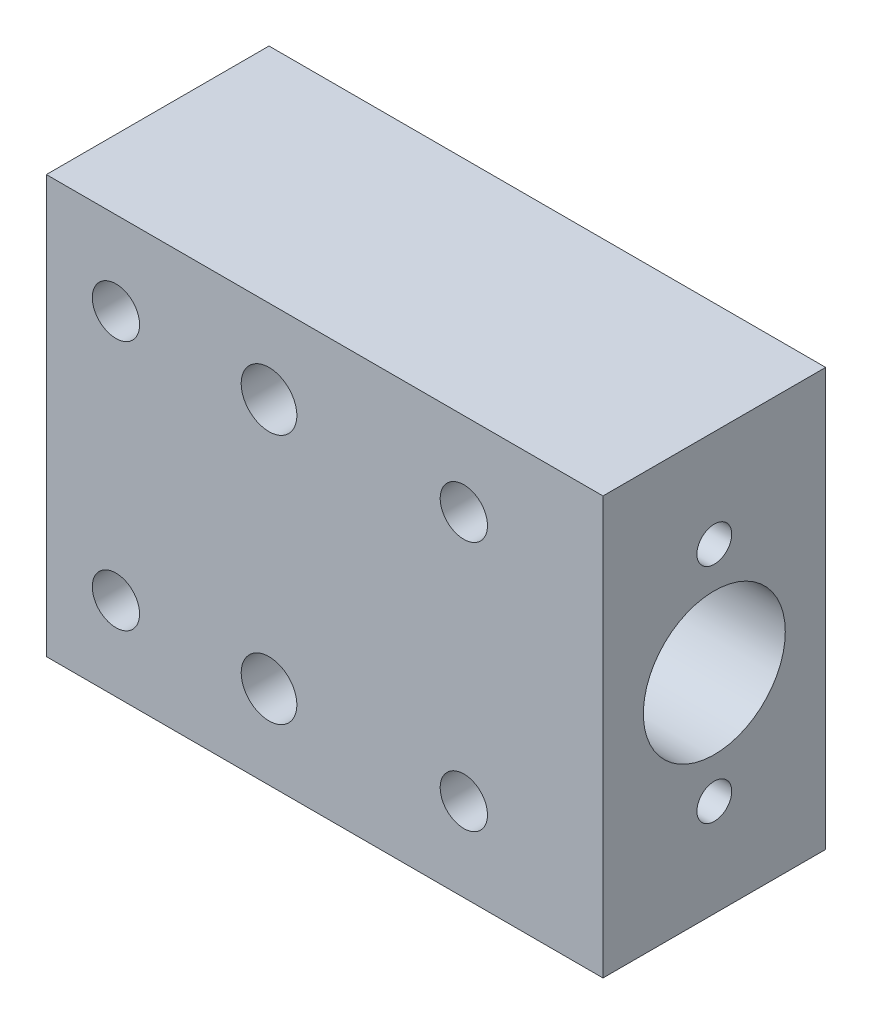
ISO-10303-21;
HEADER;
FILE_DESCRIPTION(('STEP AP214'),'2;1');
FILE_NAME('part.step','',(''),(''),'','','');
FILE_SCHEMA(('AUTOMOTIVE_DESIGN { 1 0 10303 214 1 1 1 1 }'));
ENDSEC;
DATA;
#1=APPLICATION_CONTEXT('core data for automotive mechanical design processes');
#2=APPLICATION_PROTOCOL_DEFINITION('international standard','automotive_design',2000,#1);
#3=PRODUCT_CONTEXT('',#1,'mechanical');
#4=PRODUCT('Part','Part','',(#3));
#5=PRODUCT_RELATED_PRODUCT_CATEGORY('part','',(#4));
#6=PRODUCT_DEFINITION_FORMATION('','',#4);
#7=PRODUCT_DEFINITION_CONTEXT('part definition',#1,'design');
#8=PRODUCT_DEFINITION('design','',#6,#7);
#9=PRODUCT_DEFINITION_SHAPE('','',#8);
#10=(LENGTH_UNIT() NAMED_UNIT(*) SI_UNIT(.MILLI.,.METRE.));
#11=(NAMED_UNIT(*) PLANE_ANGLE_UNIT() SI_UNIT($,.RADIAN.));
#12=(NAMED_UNIT(*) SI_UNIT($,.STERADIAN.) SOLID_ANGLE_UNIT());
#13=UNCERTAINTY_MEASURE_WITH_UNIT(LENGTH_MEASURE(1.E-05),#10,'distance_accuracy_value','');
#14=(GEOMETRIC_REPRESENTATION_CONTEXT(3) GLOBAL_UNCERTAINTY_ASSIGNED_CONTEXT((#13)) GLOBAL_UNIT_ASSIGNED_CONTEXT((#10,
#11,#12)) REPRESENTATION_CONTEXT('',''));
#15=CARTESIAN_POINT('',(0.,0.,0.));
#16=DIRECTION('',(0.,0.,1.));
#17=DIRECTION('',(1.,0.,0.));
#18=AXIS2_PLACEMENT_3D('',#15,#16,#17);
#19=CARTESIAN_POINT('',(0.,0.,16.));
#20=DIRECTION('',(1.,0.,0.));
#21=DIRECTION('',(0.,0.,-1.));
#22=AXIS2_PLACEMENT_3D('',#19,#20,#21);
#23=PLANE('',#22);
#24=CARTESIAN_POINT('',(0.,15.,8.));
#25=DIRECTION('',(1.,0.,0.));
#26=DIRECTION('',(0.,0.,-1.));
#27=AXIS2_PLACEMENT_3D('',#24,#25,#26);
#28=CIRCLE('',#27,5.1);
#29=CARTESIAN_POINT('',(0.,15.,2.9));
#30=VERTEX_POINT('',#29);
#31=EDGE_CURVE('E99',#30,#30,#28,.T.);
#32=ORIENTED_EDGE('',*,*,#31,.T.);
#33=EDGE_LOOP('',(#32));
#34=FACE_BOUND('',#33,.T.);
#35=DIRECTION('',(0.,-1.,0.));
#36=VECTOR('',#35,1.);
#37=CARTESIAN_POINT('',(0.,0.,0.));
#38=LINE('',#37,#36);
#39=CARTESIAN_POINT('',(0.,30.,0.));
#40=VERTEX_POINT('',#39);
#41=CARTESIAN_POINT('',(0.,0.,0.));
#42=VERTEX_POINT('',#41);
#43=EDGE_CURVE('E96',#40,#42,#38,.T.);
#44=ORIENTED_EDGE('',*,*,#43,.T.);
#45=DIRECTION('',(0.,0.,-1.));
#46=VECTOR('',#45,1.);
#47=CARTESIAN_POINT('',(0.,0.,16.));
#48=LINE('',#47,#46);
#49=CARTESIAN_POINT('',(0.,0.,16.));
#50=VERTEX_POINT('',#49);
#51=EDGE_CURVE('E11',#50,#42,#48,.T.);
#52=ORIENTED_EDGE('',*,*,#51,.F.);
#53=DIRECTION('',(0.,-1.,0.));
#54=VECTOR('',#53,1.);
#55=CARTESIAN_POINT('',(0.,0.,16.));
#56=LINE('',#55,#54);
#57=CARTESIAN_POINT('',(0.,30.,16.));
#58=VERTEX_POINT('',#57);
#59=EDGE_CURVE('E84',#58,#50,#56,.T.);
#60=ORIENTED_EDGE('',*,*,#59,.F.);
#61=DIRECTION('',(0.,0.,-1.));
#62=VECTOR('',#61,1.);
#63=CARTESIAN_POINT('',(0.,30.,16.));
#64=LINE('',#63,#62);
#65=EDGE_CURVE('E92',#58,#40,#64,.T.);
#66=ORIENTED_EDGE('',*,*,#65,.T.);
#67=EDGE_LOOP('',(#44,#52,#60,#66));
#68=FACE_BOUND('',#67,.T.);
#69=ADVANCED_FACE('F33',(#34,#68),#23,.F.);
#70=CARTESIAN_POINT('',(0.,0.,16.));
#71=DIRECTION('',(0.,1.,0.));
#72=DIRECTION('',(0.,0.,1.));
#73=AXIS2_PLACEMENT_3D('',#70,#71,#72);
#74=PLANE('',#73);
#75=DIRECTION('',(1.,0.,0.));
#76=VECTOR('',#75,1.);
#77=CARTESIAN_POINT('',(0.,0.,0.));
#78=LINE('',#77,#76);
#79=CARTESIAN_POINT('',(40.,0.,0.));
#80=VERTEX_POINT('',#79);
#81=EDGE_CURVE('E88',#42,#80,#78,.T.);
#82=ORIENTED_EDGE('',*,*,#81,.T.);
#83=DIRECTION('',(0.,0.,-1.));
#84=VECTOR('',#83,1.);
#85=CARTESIAN_POINT('',(40.,0.,16.));
#86=LINE('',#85,#84);
#87=CARTESIAN_POINT('',(40.,0.,16.));
#88=VERTEX_POINT('',#87);
#89=EDGE_CURVE('E41',#88,#80,#86,.T.);
#90=ORIENTED_EDGE('',*,*,#89,.F.);
#91=DIRECTION('',(1.,0.,0.));
#92=VECTOR('',#91,1.);
#93=CARTESIAN_POINT('',(0.,0.,16.));
#94=LINE('',#93,#92);
#95=EDGE_CURVE('E79',#50,#88,#94,.T.);
#96=ORIENTED_EDGE('',*,*,#95,.F.);
#97=ORIENTED_EDGE('',*,*,#51,.T.);
#98=EDGE_LOOP('',(#82,#90,#96,#97));
#99=FACE_BOUND('',#98,.T.);
#100=ADVANCED_FACE('F87',(#99),#74,.F.);
#101=CARTESIAN_POINT('',(40.,0.,16.));
#102=DIRECTION('',(-1.,0.,0.));
#103=DIRECTION('',(0.,0.,1.));
#104=AXIS2_PLACEMENT_3D('',#101,#102,#103);
#105=PLANE('',#104);
#106=CARTESIAN_POINT('',(40.,23.,8.));
#107=DIRECTION('',(1.,0.,0.));
#108=DIRECTION('',(0.,0.,-1.));
#109=AXIS2_PLACEMENT_3D('',#106,#107,#108);
#110=CIRCLE('',#109,1.25);
#111=CARTESIAN_POINT('',(40.,23.,6.75));
#112=VERTEX_POINT('',#111);
#113=EDGE_CURVE('E182',#112,#112,#110,.T.);
#114=ORIENTED_EDGE('',*,*,#113,.F.);
#115=EDGE_LOOP('',(#114));
#116=FACE_BOUND('',#115,.T.);
#117=CARTESIAN_POINT('',(40.,7.,8.));
#118=DIRECTION('',(1.,0.,0.));
#119=DIRECTION('',(0.,0.,-1.));
#120=AXIS2_PLACEMENT_3D('',#117,#118,#119);
#121=CIRCLE('',#120,1.25);
#122=CARTESIAN_POINT('',(40.,7.,6.75));
#123=VERTEX_POINT('',#122);
#124=EDGE_CURVE('E176',#123,#123,#121,.T.);
#125=ORIENTED_EDGE('',*,*,#124,.F.);
#126=EDGE_LOOP('',(#125));
#127=FACE_BOUND('',#126,.T.);
#128=CARTESIAN_POINT('',(40.,15.,8.));
#129=DIRECTION('',(1.,0.,0.));
#130=DIRECTION('',(0.,0.,-1.));
#131=AXIS2_PLACEMENT_3D('',#128,#129,#130);
#132=CIRCLE('',#131,5.1);
#133=CARTESIAN_POINT('',(40.,15.,2.9));
#134=VERTEX_POINT('',#133);
#135=EDGE_CURVE('E110',#134,#134,#132,.T.);
#136=ORIENTED_EDGE('',*,*,#135,.F.);
#137=EDGE_LOOP('',(#136));
#138=FACE_BOUND('',#137,.T.);
#139=DIRECTION('',(0.,1.,0.));
#140=VECTOR('',#139,1.);
#141=CARTESIAN_POINT('',(40.,0.,0.));
#142=LINE('',#141,#140);
#143=CARTESIAN_POINT('',(40.,30.,0.));
#144=VERTEX_POINT('',#143);
#145=EDGE_CURVE('E66',#80,#144,#142,.T.);
#146=ORIENTED_EDGE('',*,*,#145,.T.);
#147=DIRECTION('',(0.,0.,-1.));
#148=VECTOR('',#147,1.);
#149=CARTESIAN_POINT('',(40.,30.,16.));
#150=LINE('',#149,#148);
#151=CARTESIAN_POINT('',(40.,30.,16.));
#152=VERTEX_POINT('',#151);
#153=EDGE_CURVE('E89',#152,#144,#150,.T.);
#154=ORIENTED_EDGE('',*,*,#153,.F.);
#155=DIRECTION('',(0.,1.,0.));
#156=VECTOR('',#155,1.);
#157=CARTESIAN_POINT('',(40.,0.,16.));
#158=LINE('',#157,#156);
#159=EDGE_CURVE('E82',#88,#152,#158,.T.);
#160=ORIENTED_EDGE('',*,*,#159,.F.);
#161=ORIENTED_EDGE('',*,*,#89,.T.);
#162=EDGE_LOOP('',(#146,#154,#160,#161));
#163=FACE_BOUND('',#162,.T.);
#164=ADVANCED_FACE('F90',(#116,#127,#138,#163),#105,.F.);
#165=CARTESIAN_POINT('',(0.,30.,16.));
#166=DIRECTION('',(0.,-1.,0.));
#167=DIRECTION('',(0.,0.,-1.));
#168=AXIS2_PLACEMENT_3D('',#165,#166,#167);
#169=PLANE('',#168);
#170=DIRECTION('',(-1.,0.,0.));
#171=VECTOR('',#170,1.);
#172=CARTESIAN_POINT('',(0.,30.,0.));
#173=LINE('',#172,#171);
#174=EDGE_CURVE('E72',#144,#40,#173,.T.);
#175=ORIENTED_EDGE('',*,*,#174,.T.);
#176=ORIENTED_EDGE('',*,*,#65,.F.);
#177=DIRECTION('',(-1.,0.,0.));
#178=VECTOR('',#177,1.);
#179=CARTESIAN_POINT('',(0.,30.,16.));
#180=LINE('',#179,#178);
#181=EDGE_CURVE('E49',#152,#58,#180,.T.);
#182=ORIENTED_EDGE('',*,*,#181,.F.);
#183=ORIENTED_EDGE('',*,*,#153,.T.);
#184=EDGE_LOOP('',(#175,#176,#182,#183));
#185=FACE_BOUND('',#184,.T.);
#186=ADVANCED_FACE('F104',(#185),#169,.F.);
#187=CARTESIAN_POINT('',(0.,0.,16.));
#188=DIRECTION('',(0.,0.,-1.));
#189=DIRECTION('',(-1.,0.,0.));
#190=AXIS2_PLACEMENT_3D('',#187,#188,#189);
#191=PLANE('',#190);
#192=CARTESIAN_POINT('',(16.,6.,16.));
#193=DIRECTION('',(0.,0.,-1.));
#194=DIRECTION('',(-1.,0.,0.));
#195=AXIS2_PLACEMENT_3D('',#192,#193,#194);
#196=CIRCLE('',#195,2.);
#197=CARTESIAN_POINT('',(14.,6.,16.));
#198=VERTEX_POINT('',#197);
#199=EDGE_CURVE('E169',#198,#198,#196,.T.);
#200=ORIENTED_EDGE('',*,*,#199,.T.);
#201=EDGE_LOOP('',(#200));
#202=FACE_BOUND('',#201,.T.);
#203=CARTESIAN_POINT('',(16.,24.,16.));
#204=DIRECTION('',(0.,0.,-1.));
#205=DIRECTION('',(-1.,0.,0.));
#206=AXIS2_PLACEMENT_3D('',#203,#204,#205);
#207=CIRCLE('',#206,2.);
#208=CARTESIAN_POINT('',(14.,24.,16.));
#209=VERTEX_POINT('',#208);
#210=EDGE_CURVE('E163',#209,#209,#207,.T.);
#211=ORIENTED_EDGE('',*,*,#210,.T.);
#212=EDGE_LOOP('',(#211));
#213=FACE_BOUND('',#212,.T.);
#214=CARTESIAN_POINT('',(5.,6.,16.));
#215=DIRECTION('',(0.,0.,-1.));
#216=DIRECTION('',(-1.,0.,0.));
#217=AXIS2_PLACEMENT_3D('',#214,#215,#216);
#218=CIRCLE('',#217,1.69999999999999);
#219=CARTESIAN_POINT('',(3.30000000000001,6.,16.));
#220=VERTEX_POINT('',#219);
#221=EDGE_CURVE('E151',#220,#220,#218,.T.);
#222=ORIENTED_EDGE('',*,*,#221,.T.);
#223=EDGE_LOOP('',(#222));
#224=FACE_BOUND('',#223,.T.);
#225=CARTESIAN_POINT('',(30.,6.,16.));
#226=DIRECTION('',(0.,0.,-1.));
#227=DIRECTION('',(-1.,0.,0.));
#228=AXIS2_PLACEMENT_3D('',#225,#226,#227);
#229=CIRCLE('',#228,1.69999999999999);
#230=CARTESIAN_POINT('',(28.3,6.,16.));
#231=VERTEX_POINT('',#230);
#232=EDGE_CURVE('E139',#231,#231,#229,.T.);
#233=ORIENTED_EDGE('',*,*,#232,.T.);
#234=EDGE_LOOP('',(#233));
#235=FACE_BOUND('',#234,.T.);
#236=CARTESIAN_POINT('',(30.,24.,16.));
#237=DIRECTION('',(0.,0.,-1.));
#238=DIRECTION('',(-1.,0.,0.));
#239=AXIS2_PLACEMENT_3D('',#236,#237,#238);
#240=CIRCLE('',#239,1.69999999999999);
#241=CARTESIAN_POINT('',(28.3,24.,16.));
#242=VERTEX_POINT('',#241);
#243=EDGE_CURVE('E127',#242,#242,#240,.T.);
#244=ORIENTED_EDGE('',*,*,#243,.T.);
#245=EDGE_LOOP('',(#244));
#246=FACE_BOUND('',#245,.T.);
#247=CARTESIAN_POINT('',(5.,24.,16.));
#248=DIRECTION('',(0.,0.,-1.));
#249=DIRECTION('',(-1.,0.,0.));
#250=AXIS2_PLACEMENT_3D('',#247,#248,#249);
#251=CIRCLE('',#250,1.69999999999999);
#252=CARTESIAN_POINT('',(3.3,24.,16.));
#253=VERTEX_POINT('',#252);
#254=EDGE_CURVE('E113',#253,#253,#251,.T.);
#255=ORIENTED_EDGE('',*,*,#254,.T.);
#256=EDGE_LOOP('',(#255));
#257=FACE_BOUND('',#256,.T.);
#258=ORIENTED_EDGE('',*,*,#59,.T.);
#259=ORIENTED_EDGE('',*,*,#95,.T.);
#260=ORIENTED_EDGE('',*,*,#159,.T.);
#261=ORIENTED_EDGE('',*,*,#181,.T.);
#262=EDGE_LOOP('',(#258,#259,#260,#261));
#263=FACE_BOUND('',#262,.T.);
#264=ADVANCED_FACE('F80',(#202,#213,#224,#235,#246,#257,#263),#191,.F.);
#265=CARTESIAN_POINT('',(0.,0.,0.));
#266=DIRECTION('',(0.,0.,-1.));
#267=DIRECTION('',(-1.,0.,0.));
#268=AXIS2_PLACEMENT_3D('',#265,#266,#267);
#269=PLANE('',#268);
#270=CARTESIAN_POINT('',(16.,6.,0.));
#271=DIRECTION('',(0.,0.,-1.));
#272=DIRECTION('',(-1.,0.,0.));
#273=AXIS2_PLACEMENT_3D('',#270,#271,#272);
#274=CIRCLE('',#273,2.);
#275=CARTESIAN_POINT('',(14.,6.,0.));
#276=VERTEX_POINT('',#275);
#277=EDGE_CURVE('E172',#276,#276,#274,.T.);
#278=ORIENTED_EDGE('',*,*,#277,.F.);
#279=EDGE_LOOP('',(#278));
#280=FACE_BOUND('',#279,.T.);
#281=CARTESIAN_POINT('',(16.,24.,0.));
#282=DIRECTION('',(0.,0.,-1.));
#283=DIRECTION('',(-1.,0.,0.));
#284=AXIS2_PLACEMENT_3D('',#281,#282,#283);
#285=CIRCLE('',#284,2.);
#286=CARTESIAN_POINT('',(14.,24.,0.));
#287=VERTEX_POINT('',#286);
#288=EDGE_CURVE('E166',#287,#287,#285,.T.);
#289=ORIENTED_EDGE('',*,*,#288,.F.);
#290=EDGE_LOOP('',(#289));
#291=FACE_BOUND('',#290,.T.);
#292=CARTESIAN_POINT('',(5.,6.,0.));
#293=DIRECTION('',(0.,0.,-1.));
#294=DIRECTION('',(-1.,0.,0.));
#295=AXIS2_PLACEMENT_3D('',#292,#293,#294);
#296=CIRCLE('',#295,3.25);
#297=CARTESIAN_POINT('',(1.75,6.,0.));
#298=VERTEX_POINT('',#297);
#299=EDGE_CURVE('E160',#298,#298,#296,.T.);
#300=ORIENTED_EDGE('',*,*,#299,.F.);
#301=EDGE_LOOP('',(#300));
#302=FACE_BOUND('',#301,.T.);
#303=CARTESIAN_POINT('',(30.,6.,0.));
#304=DIRECTION('',(0.,0.,-1.));
#305=DIRECTION('',(-1.,0.,0.));
#306=AXIS2_PLACEMENT_3D('',#303,#304,#305);
#307=CIRCLE('',#306,3.25);
#308=CARTESIAN_POINT('',(26.75,6.,0.));
#309=VERTEX_POINT('',#308);
#310=EDGE_CURVE('E148',#309,#309,#307,.T.);
#311=ORIENTED_EDGE('',*,*,#310,.F.);
#312=EDGE_LOOP('',(#311));
#313=FACE_BOUND('',#312,.T.);
#314=CARTESIAN_POINT('',(30.,24.,0.));
#315=DIRECTION('',(0.,0.,-1.));
#316=DIRECTION('',(-1.,0.,0.));
#317=AXIS2_PLACEMENT_3D('',#314,#315,#316);
#318=CIRCLE('',#317,3.25);
#319=CARTESIAN_POINT('',(26.75,24.,0.));
#320=VERTEX_POINT('',#319);
#321=EDGE_CURVE('E136',#320,#320,#318,.T.);
#322=ORIENTED_EDGE('',*,*,#321,.F.);
#323=EDGE_LOOP('',(#322));
#324=FACE_BOUND('',#323,.T.);
#325=CARTESIAN_POINT('',(5.,24.,0.));
#326=DIRECTION('',(0.,0.,-1.));
#327=DIRECTION('',(-1.,0.,0.));
#328=AXIS2_PLACEMENT_3D('',#325,#326,#327);
#329=CIRCLE('',#328,3.25);
#330=CARTESIAN_POINT('',(1.75,24.,0.));
#331=VERTEX_POINT('',#330);
#332=EDGE_CURVE('E124',#331,#331,#329,.T.);
#333=ORIENTED_EDGE('',*,*,#332,.F.);
#334=EDGE_LOOP('',(#333));
#335=FACE_BOUND('',#334,.T.);
#336=ORIENTED_EDGE('',*,*,#43,.F.);
#337=ORIENTED_EDGE('',*,*,#174,.F.);
#338=ORIENTED_EDGE('',*,*,#145,.F.);
#339=ORIENTED_EDGE('',*,*,#81,.F.);
#340=EDGE_LOOP('',(#336,#337,#338,#339));
#341=FACE_BOUND('',#340,.T.);
#342=ADVANCED_FACE('F107',(#280,#291,#302,#313,#324,#335,#341),#269,.T.);
#343=CARTESIAN_POINT('',(0.,15.,8.));
#344=DIRECTION('',(1.,0.,0.));
#345=DIRECTION('',(0.,0.,-1.));
#346=AXIS2_PLACEMENT_3D('',#343,#344,#345);
#347=CYLINDRICAL_SURFACE('',#346,5.1);
#348=ORIENTED_EDGE('',*,*,#31,.F.);
#349=EDGE_LOOP('',(#348));
#350=FACE_BOUND('',#349,.T.);
#351=ORIENTED_EDGE('',*,*,#135,.T.);
#352=EDGE_LOOP('',(#351));
#353=FACE_BOUND('',#352,.T.);
#354=ADVANCED_FACE('F204',(#350,#353),#347,.F.);
#355=CARTESIAN_POINT('',(5.,24.,0.));
#356=DIRECTION('',(0.,0.,-1.));
#357=DIRECTION('',(-1.,0.,0.));
#358=AXIS2_PLACEMENT_3D('',#355,#356,#357);
#359=CYLINDRICAL_SURFACE('',#358,1.7);
#360=ORIENTED_EDGE('',*,*,#254,.F.);
#361=EDGE_LOOP('',(#360));
#362=FACE_BOUND('',#361,.T.);
#363=CARTESIAN_POINT('',(5.,24.,3.4));
#364=DIRECTION('',(0.,0.,-1.));
#365=DIRECTION('',(-1.,0.,0.));
#366=AXIS2_PLACEMENT_3D('',#363,#364,#365);
#367=CIRCLE('',#366,1.70000000000001);
#368=CARTESIAN_POINT('',(3.29999999999999,24.,3.4));
#369=VERTEX_POINT('',#368);
#370=EDGE_CURVE('E118',#369,#369,#367,.T.);
#371=ORIENTED_EDGE('',*,*,#370,.T.);
#372=EDGE_LOOP('',(#371));
#373=FACE_BOUND('',#372,.T.);
#374=ADVANCED_FACE('F206',(#362,#373),#359,.F.);
#375=CARTESIAN_POINT('',(6.70000000000001,24.,3.4));
#376=DIRECTION('',(0.,0.,1.));
#377=DIRECTION('',(1.,0.,0.));
#378=AXIS2_PLACEMENT_3D('',#375,#376,#377);
#379=PLANE('',#378);
#380=ORIENTED_EDGE('',*,*,#370,.F.);
#381=EDGE_LOOP('',(#380));
#382=FACE_BOUND('',#381,.T.);
#383=CARTESIAN_POINT('',(5.,24.,3.4));
#384=DIRECTION('',(0.,0.,-1.));
#385=DIRECTION('',(-1.,0.,0.));
#386=AXIS2_PLACEMENT_3D('',#383,#384,#385);
#387=CIRCLE('',#386,3.25);
#388=CARTESIAN_POINT('',(1.75,24.,3.4));
#389=VERTEX_POINT('',#388);
#390=EDGE_CURVE('E121',#389,#389,#387,.T.);
#391=ORIENTED_EDGE('',*,*,#390,.T.);
#392=EDGE_LOOP('',(#391));
#393=FACE_BOUND('',#392,.T.);
#394=ADVANCED_FACE('F213',(#382,#393),#379,.F.);
#395=CARTESIAN_POINT('',(5.,24.,0.));
#396=DIRECTION('',(0.,0.,-1.));
#397=DIRECTION('',(-1.,0.,0.));
#398=AXIS2_PLACEMENT_3D('',#395,#396,#397);
#399=CYLINDRICAL_SURFACE('',#398,3.25);
#400=ORIENTED_EDGE('',*,*,#390,.F.);
#401=EDGE_LOOP('',(#400));
#402=FACE_BOUND('',#401,.T.);
#403=ORIENTED_EDGE('',*,*,#332,.T.);
#404=EDGE_LOOP('',(#403));
#405=FACE_BOUND('',#404,.T.);
#406=ADVANCED_FACE('F249',(#402,#405),#399,.F.);
#407=CARTESIAN_POINT('',(30.,24.,0.));
#408=DIRECTION('',(0.,0.,-1.));
#409=DIRECTION('',(-1.,0.,0.));
#410=AXIS2_PLACEMENT_3D('',#407,#408,#409);
#411=CYLINDRICAL_SURFACE('',#410,1.7);
#412=ORIENTED_EDGE('',*,*,#243,.F.);
#413=EDGE_LOOP('',(#412));
#414=FACE_BOUND('',#413,.T.);
#415=CARTESIAN_POINT('',(30.,24.,3.4));
#416=DIRECTION('',(0.,0.,-1.));
#417=DIRECTION('',(-1.,0.,0.));
#418=AXIS2_PLACEMENT_3D('',#415,#416,#417);
#419=CIRCLE('',#418,1.70000000000001);
#420=CARTESIAN_POINT('',(28.3,24.,3.4));
#421=VERTEX_POINT('',#420);
#422=EDGE_CURVE('E130',#421,#421,#419,.T.);
#423=ORIENTED_EDGE('',*,*,#422,.T.);
#424=EDGE_LOOP('',(#423));
#425=FACE_BOUND('',#424,.T.);
#426=ADVANCED_FACE('F255',(#414,#425),#411,.F.);
#427=CARTESIAN_POINT('',(31.7,24.,3.4));
#428=DIRECTION('',(0.,0.,1.));
#429=DIRECTION('',(1.,0.,0.));
#430=AXIS2_PLACEMENT_3D('',#427,#428,#429);
#431=PLANE('',#430);
#432=ORIENTED_EDGE('',*,*,#422,.F.);
#433=EDGE_LOOP('',(#432));
#434=FACE_BOUND('',#433,.T.);
#435=CARTESIAN_POINT('',(30.,24.,3.4));
#436=DIRECTION('',(0.,0.,-1.));
#437=DIRECTION('',(-1.,0.,0.));
#438=AXIS2_PLACEMENT_3D('',#435,#436,#437);
#439=CIRCLE('',#438,3.25);
#440=CARTESIAN_POINT('',(26.75,24.,3.4));
#441=VERTEX_POINT('',#440);
#442=EDGE_CURVE('E133',#441,#441,#439,.T.);
#443=ORIENTED_EDGE('',*,*,#442,.T.);
#444=EDGE_LOOP('',(#443));
#445=FACE_BOUND('',#444,.T.);
#446=ADVANCED_FACE('F262',(#434,#445),#431,.F.);
#447=CARTESIAN_POINT('',(30.,24.,0.));
#448=DIRECTION('',(0.,0.,-1.));
#449=DIRECTION('',(-1.,0.,0.));
#450=AXIS2_PLACEMENT_3D('',#447,#448,#449);
#451=CYLINDRICAL_SURFACE('',#450,3.25);
#452=ORIENTED_EDGE('',*,*,#442,.F.);
#453=EDGE_LOOP('',(#452));
#454=FACE_BOUND('',#453,.T.);
#455=ORIENTED_EDGE('',*,*,#321,.T.);
#456=EDGE_LOOP('',(#455));
#457=FACE_BOUND('',#456,.T.);
#458=ADVANCED_FACE('F268',(#454,#457),#451,.F.);
#459=CARTESIAN_POINT('',(30.,6.,0.));
#460=DIRECTION('',(0.,0.,-1.));
#461=DIRECTION('',(-1.,0.,0.));
#462=AXIS2_PLACEMENT_3D('',#459,#460,#461);
#463=CYLINDRICAL_SURFACE('',#462,1.7);
#464=ORIENTED_EDGE('',*,*,#232,.F.);
#465=EDGE_LOOP('',(#464));
#466=FACE_BOUND('',#465,.T.);
#467=CARTESIAN_POINT('',(30.,6.,3.4));
#468=DIRECTION('',(0.,0.,-1.));
#469=DIRECTION('',(-1.,0.,0.));
#470=AXIS2_PLACEMENT_3D('',#467,#468,#469);
#471=CIRCLE('',#470,1.70000000000001);
#472=CARTESIAN_POINT('',(28.3,6.,3.4));
#473=VERTEX_POINT('',#472);
#474=EDGE_CURVE('E142',#473,#473,#471,.T.);
#475=ORIENTED_EDGE('',*,*,#474,.T.);
#476=EDGE_LOOP('',(#475));
#477=FACE_BOUND('',#476,.T.);
#478=ADVANCED_FACE('F272',(#466,#477),#463,.F.);
#479=CARTESIAN_POINT('',(31.7,6.,3.4));
#480=DIRECTION('',(0.,0.,1.));
#481=DIRECTION('',(1.,0.,0.));
#482=AXIS2_PLACEMENT_3D('',#479,#480,#481);
#483=PLANE('',#482);
#484=ORIENTED_EDGE('',*,*,#474,.F.);
#485=EDGE_LOOP('',(#484));
#486=FACE_BOUND('',#485,.T.);
#487=CARTESIAN_POINT('',(30.,6.,3.4));
#488=DIRECTION('',(0.,0.,-1.));
#489=DIRECTION('',(-1.,0.,0.));
#490=AXIS2_PLACEMENT_3D('',#487,#488,#489);
#491=CIRCLE('',#490,3.25);
#492=CARTESIAN_POINT('',(26.75,6.,3.4));
#493=VERTEX_POINT('',#492);
#494=EDGE_CURVE('E145',#493,#493,#491,.T.);
#495=ORIENTED_EDGE('',*,*,#494,.T.);
#496=EDGE_LOOP('',(#495));
#497=FACE_BOUND('',#496,.T.);
#498=ADVANCED_FACE('F276',(#486,#497),#483,.F.);
#499=CARTESIAN_POINT('',(30.,6.,0.));
#500=DIRECTION('',(0.,0.,-1.));
#501=DIRECTION('',(-1.,0.,0.));
#502=AXIS2_PLACEMENT_3D('',#499,#500,#501);
#503=CYLINDRICAL_SURFACE('',#502,3.25);
#504=ORIENTED_EDGE('',*,*,#494,.F.);
#505=EDGE_LOOP('',(#504));
#506=FACE_BOUND('',#505,.T.);
#507=ORIENTED_EDGE('',*,*,#310,.T.);
#508=EDGE_LOOP('',(#507));
#509=FACE_BOUND('',#508,.T.);
#510=ADVANCED_FACE('F280',(#506,#509),#503,.F.);
#511=CARTESIAN_POINT('',(5.,6.,0.));
#512=DIRECTION('',(0.,0.,-1.));
#513=DIRECTION('',(-1.,0.,0.));
#514=AXIS2_PLACEMENT_3D('',#511,#512,#513);
#515=CYLINDRICAL_SURFACE('',#514,1.7);
#516=ORIENTED_EDGE('',*,*,#221,.F.);
#517=EDGE_LOOP('',(#516));
#518=FACE_BOUND('',#517,.T.);
#519=CARTESIAN_POINT('',(5.,6.,3.4));
#520=DIRECTION('',(0.,0.,-1.));
#521=DIRECTION('',(-1.,0.,0.));
#522=AXIS2_PLACEMENT_3D('',#519,#520,#521);
#523=CIRCLE('',#522,1.70000000000001);
#524=CARTESIAN_POINT('',(3.29999999999999,6.,3.4));
#525=VERTEX_POINT('',#524);
#526=EDGE_CURVE('E154',#525,#525,#523,.T.);
#527=ORIENTED_EDGE('',*,*,#526,.T.);
#528=EDGE_LOOP('',(#527));
#529=FACE_BOUND('',#528,.T.);
#530=ADVANCED_FACE('F284',(#518,#529),#515,.F.);
#531=CARTESIAN_POINT('',(6.70000000000001,6.,3.4));
#532=DIRECTION('',(0.,0.,1.));
#533=DIRECTION('',(1.,0.,0.));
#534=AXIS2_PLACEMENT_3D('',#531,#532,#533);
#535=PLANE('',#534);
#536=ORIENTED_EDGE('',*,*,#526,.F.);
#537=EDGE_LOOP('',(#536));
#538=FACE_BOUND('',#537,.T.);
#539=CARTESIAN_POINT('',(5.,6.,3.4));
#540=DIRECTION('',(0.,0.,-1.));
#541=DIRECTION('',(-1.,0.,0.));
#542=AXIS2_PLACEMENT_3D('',#539,#540,#541);
#543=CIRCLE('',#542,3.25);
#544=CARTESIAN_POINT('',(1.75,6.,3.4));
#545=VERTEX_POINT('',#544);
#546=EDGE_CURVE('E157',#545,#545,#543,.T.);
#547=ORIENTED_EDGE('',*,*,#546,.T.);
#548=EDGE_LOOP('',(#547));
#549=FACE_BOUND('',#548,.T.);
#550=ADVANCED_FACE('F288',(#538,#549),#535,.F.);
#551=CARTESIAN_POINT('',(5.,6.,0.));
#552=DIRECTION('',(0.,0.,-1.));
#553=DIRECTION('',(-1.,0.,0.));
#554=AXIS2_PLACEMENT_3D('',#551,#552,#553);
#555=CYLINDRICAL_SURFACE('',#554,3.25);
#556=ORIENTED_EDGE('',*,*,#546,.F.);
#557=EDGE_LOOP('',(#556));
#558=FACE_BOUND('',#557,.T.);
#559=ORIENTED_EDGE('',*,*,#299,.T.);
#560=EDGE_LOOP('',(#559));
#561=FACE_BOUND('',#560,.T.);
#562=ADVANCED_FACE('F292',(#558,#561),#555,.F.);
#563=CARTESIAN_POINT('',(16.,24.,0.));
#564=DIRECTION('',(0.,0.,-1.));
#565=DIRECTION('',(-1.,0.,0.));
#566=AXIS2_PLACEMENT_3D('',#563,#564,#565);
#567=CYLINDRICAL_SURFACE('',#566,2.);
#568=ORIENTED_EDGE('',*,*,#210,.F.);
#569=EDGE_LOOP('',(#568));
#570=FACE_BOUND('',#569,.T.);
#571=ORIENTED_EDGE('',*,*,#288,.T.);
#572=EDGE_LOOP('',(#571));
#573=FACE_BOUND('',#572,.T.);
#574=ADVANCED_FACE('F296',(#570,#573),#567,.F.);
#575=CARTESIAN_POINT('',(16.,6.,0.));
#576=DIRECTION('',(0.,0.,-1.));
#577=DIRECTION('',(-1.,0.,0.));
#578=AXIS2_PLACEMENT_3D('',#575,#576,#577);
#579=CYLINDRICAL_SURFACE('',#578,2.);
#580=ORIENTED_EDGE('',*,*,#199,.F.);
#581=EDGE_LOOP('',(#580));
#582=FACE_BOUND('',#581,.T.);
#583=ORIENTED_EDGE('',*,*,#277,.T.);
#584=EDGE_LOOP('',(#583));
#585=FACE_BOUND('',#584,.T.);
#586=ADVANCED_FACE('F300',(#582,#585),#579,.F.);
#587=CARTESIAN_POINT('',(33.,7.,8.));
#588=DIRECTION('',(1.,0.,0.));
#589=DIRECTION('',(0.,0.,-1.));
#590=AXIS2_PLACEMENT_3D('',#587,#588,#589);
#591=CYLINDRICAL_SURFACE('',#590,1.25);
#592=CARTESIAN_POINT('',(33.,7.,8.));
#593=DIRECTION('',(1.,0.,0.));
#594=DIRECTION('',(0.,0.,-1.));
#595=AXIS2_PLACEMENT_3D('',#592,#593,#594);
#596=CIRCLE('',#595,1.25);
#597=CARTESIAN_POINT('',(33.,7.,6.75));
#598=VERTEX_POINT('',#597);
#599=EDGE_CURVE('E179',#598,#598,#596,.T.);
#600=ORIENTED_EDGE('',*,*,#599,.F.);
#601=EDGE_LOOP('',(#600));
#602=FACE_BOUND('',#601,.T.);
#603=ORIENTED_EDGE('',*,*,#124,.T.);
#604=EDGE_LOOP('',(#603));
#605=FACE_BOUND('',#604,.T.);
#606=ADVANCED_FACE('F304',(#602,#605),#591,.F.);
#607=CARTESIAN_POINT('',(33.,7.,8.));
#608=DIRECTION('',(1.,0.,0.));
#609=DIRECTION('',(0.,0.,-1.));
#610=AXIS2_PLACEMENT_3D('',#607,#608,#609);
#611=PLANE('',#610);
#612=ORIENTED_EDGE('',*,*,#599,.T.);
#613=EDGE_LOOP('',(#612));
#614=FACE_BOUND('',#613,.T.);
#615=ADVANCED_FACE('F193',(#614),#611,.T.);
#616=CARTESIAN_POINT('',(33.,23.,8.));
#617=DIRECTION('',(1.,0.,0.));
#618=DIRECTION('',(0.,0.,-1.));
#619=AXIS2_PLACEMENT_3D('',#616,#617,#618);
#620=CYLINDRICAL_SURFACE('',#619,1.25);
#621=CARTESIAN_POINT('',(33.,23.,8.));
#622=DIRECTION('',(1.,0.,0.));
#623=DIRECTION('',(0.,0.,-1.));
#624=AXIS2_PLACEMENT_3D('',#621,#622,#623);
#625=CIRCLE('',#624,1.25);
#626=CARTESIAN_POINT('',(33.,23.,6.75));
#627=VERTEX_POINT('',#626);
#628=EDGE_CURVE('E175',#627,#627,#625,.T.);
#629=ORIENTED_EDGE('',*,*,#628,.F.);
#630=EDGE_LOOP('',(#629));
#631=FACE_BOUND('',#630,.T.);
#632=ORIENTED_EDGE('',*,*,#113,.T.);
#633=EDGE_LOOP('',(#632));
#634=FACE_BOUND('',#633,.T.);
#635=ADVANCED_FACE('F190',(#631,#634),#620,.F.);
#636=CARTESIAN_POINT('',(33.,23.,8.));
#637=DIRECTION('',(1.,0.,0.));
#638=DIRECTION('',(0.,0.,-1.));
#639=AXIS2_PLACEMENT_3D('',#636,#637,#638);
#640=PLANE('',#639);
#641=ORIENTED_EDGE('',*,*,#628,.T.);
#642=EDGE_LOOP('',(#641));
#643=FACE_BOUND('',#642,.T.);
#644=ADVANCED_FACE('F188',(#643),#640,.T.);
#645=CLOSED_SHELL('',(#69,#100,#164,#186,#264,#342,#354,#374,#394,#406,#426,#446,#458,#478,#498,
#510,#530,#550,#562,#574,#586,#606,#615,#635,#644));
#646=MANIFOLD_SOLID_BREP('B2',#645);
#647=ADVANCED_BREP_SHAPE_REPRESENTATION('',(#18,#646),#14);
#648=SHAPE_DEFINITION_REPRESENTATION(#9,#647);
ENDSEC;
END-ISO-10303-21;
